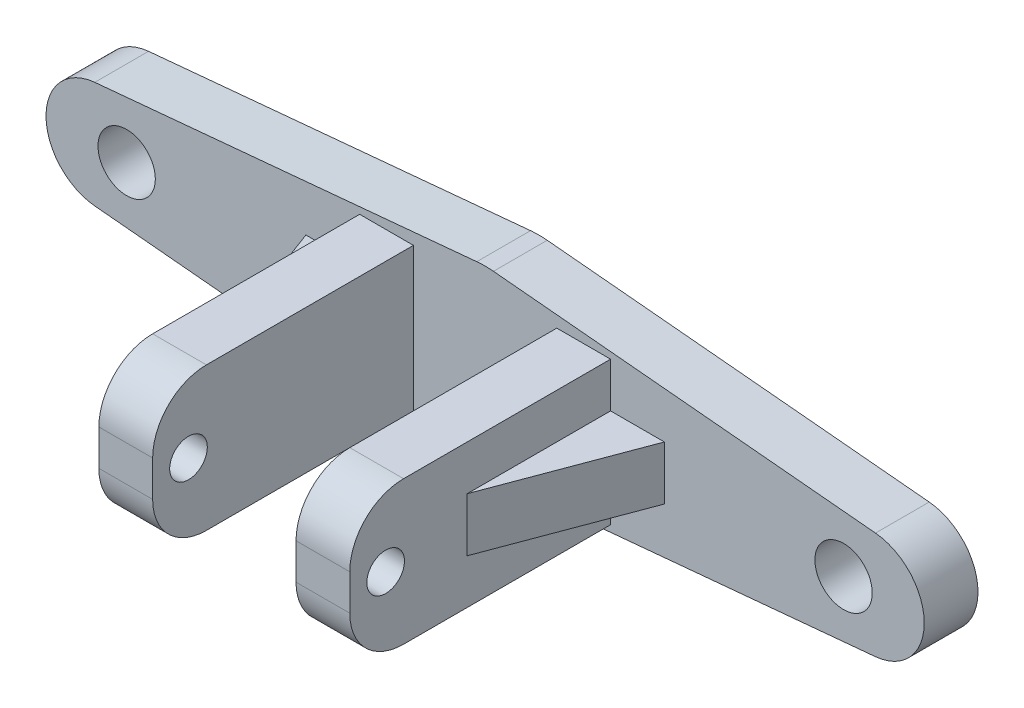
ISO-10303-21;
HEADER;
FILE_DESCRIPTION(('STEP AP214'),'2;1');
FILE_NAME('part.step','',(''),(''),'','','');
FILE_SCHEMA(('AUTOMOTIVE_DESIGN { 1 0 10303 214 1 1 1 1 }'));
ENDSEC;
DATA;
#1=APPLICATION_CONTEXT('core data for automotive mechanical design processes');
#2=APPLICATION_PROTOCOL_DEFINITION('international standard','automotive_design',2000,#1);
#3=PRODUCT_CONTEXT('',#1,'mechanical');
#4=PRODUCT('Part','Part','',(#3));
#5=PRODUCT_RELATED_PRODUCT_CATEGORY('part','',(#4));
#6=PRODUCT_DEFINITION_FORMATION('','',#4);
#7=PRODUCT_DEFINITION_CONTEXT('part definition',#1,'design');
#8=PRODUCT_DEFINITION('design','',#6,#7);
#9=PRODUCT_DEFINITION_SHAPE('','',#8);
#10=(LENGTH_UNIT() NAMED_UNIT(*) SI_UNIT(.MILLI.,.METRE.));
#11=(NAMED_UNIT(*) PLANE_ANGLE_UNIT() SI_UNIT($,.RADIAN.));
#12=(NAMED_UNIT(*) SI_UNIT($,.STERADIAN.) SOLID_ANGLE_UNIT());
#13=UNCERTAINTY_MEASURE_WITH_UNIT(LENGTH_MEASURE(1.E-05),#10,'distance_accuracy_value','');
#14=(GEOMETRIC_REPRESENTATION_CONTEXT(3) GLOBAL_UNCERTAINTY_ASSIGNED_CONTEXT((#13)) GLOBAL_UNIT_ASSIGNED_CONTEXT((#10,
#11,#12)) REPRESENTATION_CONTEXT('',''));
#15=CARTESIAN_POINT('',(0.,0.,0.));
#16=DIRECTION('',(0.,0.,1.));
#17=DIRECTION('',(1.,0.,0.));
#18=AXIS2_PLACEMENT_3D('',#15,#16,#17);
#19=CARTESIAN_POINT('',(7.,-4.,17.55));
#20=DIRECTION('',(0.,1.,0.));
#21=DIRECTION('',(-1.,0.,0.));
#22=AXIS2_PLACEMENT_3D('',#19,#20,#21);
#23=PLANE('',#22);
#24=DIRECTION('',(0.,0.,1.));
#25=VECTOR('',#24,1.);
#26=CARTESIAN_POINT('',(-4.,-4.,17.55));
#27=LINE('',#26,#25);
#28=CARTESIAN_POINT('',(-4.,-4.,3.));
#29=VERTEX_POINT('',#28);
#30=CARTESIAN_POINT('',(-4.,-4.,14.55));
#31=VERTEX_POINT('',#30);
#32=EDGE_CURVE('E310',#29,#31,#27,.T.);
#33=ORIENTED_EDGE('',*,*,#32,.T.);
#34=DIRECTION('',(1.,0.,0.));
#35=VECTOR('',#34,1.);
#36=CARTESIAN_POINT('',(-7.,-4.,14.55));
#37=LINE('',#36,#35);
#38=CARTESIAN_POINT('',(-7.,-4.,14.55));
#39=VERTEX_POINT('',#38);
#40=EDGE_CURVE('E497',#31,#39,#37,.F.);
#41=ORIENTED_EDGE('',*,*,#40,.T.);
#42=DIRECTION('',(0.,0.,-1.));
#43=VECTOR('',#42,1.);
#44=CARTESIAN_POINT('',(-7.,-4.,17.55));
#45=LINE('',#44,#43);
#46=CARTESIAN_POINT('',(-7.,-4.,3.));
#47=VERTEX_POINT('',#46);
#48=EDGE_CURVE('E350',#39,#47,#45,.T.);
#49=ORIENTED_EDGE('',*,*,#48,.T.);
#50=DIRECTION('',(1.,0.,0.));
#51=VECTOR('',#50,1.);
#52=CARTESIAN_POINT('',(7.,-4.,3.));
#53=LINE('',#52,#51);
#54=EDGE_CURVE('E329',#47,#29,#53,.T.);
#55=ORIENTED_EDGE('',*,*,#54,.T.);
#56=EDGE_LOOP('',(#33,#41,#49,#55));
#57=FACE_BOUND('',#56,.T.);
#58=ADVANCED_FACE('F42',(#57),#23,.F.);
#59=CARTESIAN_POINT('',(7.,4.,17.55));
#60=DIRECTION('',(0.,-1.,0.));
#61=DIRECTION('',(1.,0.,0.));
#62=AXIS2_PLACEMENT_3D('',#59,#60,#61);
#63=PLANE('',#62);
#64=DIRECTION('',(0.,0.,-1.));
#65=VECTOR('',#64,1.);
#66=CARTESIAN_POINT('',(-7.,4.,17.55));
#67=LINE('',#66,#65);
#68=CARTESIAN_POINT('',(-7.,4.,14.55));
#69=VERTEX_POINT('',#68);
#70=CARTESIAN_POINT('',(-7.,4.,3.));
#71=VERTEX_POINT('',#70);
#72=EDGE_CURVE('E324',#69,#71,#67,.T.);
#73=ORIENTED_EDGE('',*,*,#72,.F.);
#74=DIRECTION('',(-1.,0.,0.));
#75=VECTOR('',#74,1.);
#76=CARTESIAN_POINT('',(-4.,4.,14.55));
#77=LINE('',#76,#75);
#78=CARTESIAN_POINT('',(-4.,4.,14.55));
#79=VERTEX_POINT('',#78);
#80=EDGE_CURVE('E11',#69,#79,#77,.F.);
#81=ORIENTED_EDGE('',*,*,#80,.T.);
#82=DIRECTION('',(0.,0.,1.));
#83=VECTOR('',#82,1.);
#84=CARTESIAN_POINT('',(-4.,4.,17.55));
#85=LINE('',#84,#83);
#86=CARTESIAN_POINT('',(-4.,4.,3.));
#87=VERTEX_POINT('',#86);
#88=EDGE_CURVE('E293',#87,#79,#85,.T.);
#89=ORIENTED_EDGE('',*,*,#88,.F.);
#90=DIRECTION('',(-1.,0.,0.));
#91=VECTOR('',#90,1.);
#92=CARTESIAN_POINT('',(7.,4.,3.));
#93=LINE('',#92,#91);
#94=EDGE_CURVE('E337',#87,#71,#93,.T.);
#95=ORIENTED_EDGE('',*,*,#94,.T.);
#96=EDGE_LOOP('',(#73,#81,#89,#95));
#97=FACE_BOUND('',#96,.T.);
#98=ADVANCED_FACE('F525',(#97),#63,.F.);
#99=CARTESIAN_POINT('',(0.,0.,17.55));
#100=DIRECTION('',(0.,0.,1.));
#101=DIRECTION('',(1.,0.,0.));
#102=AXIS2_PLACEMENT_3D('',#99,#100,#101);
#103=PLANE('',#102);
#104=DIRECTION('',(1.,0.,0.));
#105=VECTOR('',#104,1.);
#106=CARTESIAN_POINT('',(-4.,-1.,17.55));
#107=LINE('',#106,#105);
#108=CARTESIAN_POINT('',(-7.,-1.,17.55));
#109=VERTEX_POINT('',#108);
#110=CARTESIAN_POINT('',(-4.,-1.,17.55));
#111=VERTEX_POINT('',#110);
#112=EDGE_CURVE('E488',#109,#111,#107,.T.);
#113=ORIENTED_EDGE('',*,*,#112,.T.);
#114=DIRECTION('',(0.,-1.,0.));
#115=VECTOR('',#114,1.);
#116=CARTESIAN_POINT('',(-4.,0.,17.55));
#117=LINE('',#116,#115);
#118=CARTESIAN_POINT('',(-4.,1.,17.55));
#119=VERTEX_POINT('',#118);
#120=EDGE_CURVE('E454',#119,#111,#117,.T.);
#121=ORIENTED_EDGE('',*,*,#120,.F.);
#122=DIRECTION('',(-1.,0.,0.));
#123=VECTOR('',#122,1.);
#124=CARTESIAN_POINT('',(-7.,1.,17.55));
#125=LINE('',#124,#123);
#126=CARTESIAN_POINT('',(-7.,1.,17.55));
#127=VERTEX_POINT('',#126);
#128=EDGE_CURVE('E485',#119,#127,#125,.T.);
#129=ORIENTED_EDGE('',*,*,#128,.T.);
#130=DIRECTION('',(0.,-1.,0.));
#131=VECTOR('',#130,1.);
#132=CARTESIAN_POINT('',(-7.,-4.,17.55));
#133=LINE('',#132,#131);
#134=EDGE_CURVE('E315',#127,#109,#133,.T.);
#135=ORIENTED_EDGE('',*,*,#134,.T.);
#136=EDGE_LOOP('',(#113,#121,#129,#135));
#137=FACE_BOUND('',#136,.T.);
#138=ADVANCED_FACE('F510',(#137),#103,.T.);
#139=CARTESIAN_POINT('',(-21.5,0.,3.));
#140=DIRECTION('',(0.,0.,1.));
#141=DIRECTION('',(1.,0.,0.));
#142=AXIS2_PLACEMENT_3D('',#139,#140,#141);
#143=PLANE('',#142);
#144=CARTESIAN_POINT('',(20.,0.,3.));
#145=DIRECTION('',(0.,0.,1.));
#146=DIRECTION('',(1.,0.,0.));
#147=AXIS2_PLACEMENT_3D('',#144,#145,#146);
#148=CIRCLE('',#147,1.6);
#149=CARTESIAN_POINT('',(21.6,0.,3.));
#150=VERTEX_POINT('',#149);
#151=EDGE_CURVE('E364',#150,#150,#148,.T.);
#152=ORIENTED_EDGE('',*,*,#151,.F.);
#153=EDGE_LOOP('',(#152));
#154=FACE_BOUND('',#153,.T.);
#155=DIRECTION('',(-1.,0.,0.));
#156=VECTOR('',#155,1.);
#157=CARTESIAN_POINT('',(-21.5,1.5,3.));
#158=LINE('',#157,#156);
#159=CARTESIAN_POINT('',(9.99999999999999,1.5,3.));
#160=VERTEX_POINT('',#159);
#161=CARTESIAN_POINT('',(7.,1.5,3.));
#162=VERTEX_POINT('',#161);
#163=EDGE_CURVE('E258',#160,#162,#158,.T.);
#164=ORIENTED_EDGE('',*,*,#163,.F.);
#165=DIRECTION('',(0.,-1.,0.));
#166=VECTOR('',#165,1.);
#167=CARTESIAN_POINT('',(9.99999999999999,0.,3.));
#168=LINE('',#167,#166);
#169=CARTESIAN_POINT('',(10.,-1.5,3.));
#170=VERTEX_POINT('',#169);
#171=EDGE_CURVE('E276',#170,#160,#168,.F.);
#172=ORIENTED_EDGE('',*,*,#171,.F.);
#173=DIRECTION('',(-1.,0.,0.));
#174=VECTOR('',#173,1.);
#175=CARTESIAN_POINT('',(-21.5,-1.5,3.));
#176=LINE('',#175,#174);
#177=CARTESIAN_POINT('',(7.,-1.5,3.));
#178=VERTEX_POINT('',#177);
#179=EDGE_CURVE('E265',#170,#178,#176,.T.);
#180=ORIENTED_EDGE('',*,*,#179,.T.);
#181=DIRECTION('',(0.,1.,0.));
#182=VECTOR('',#181,1.);
#183=CARTESIAN_POINT('',(7.,-4.,3.));
#184=LINE('',#183,#182);
#185=CARTESIAN_POINT('',(7.,-4.,3.));
#186=VERTEX_POINT('',#185);
#187=EDGE_CURVE('E334',#186,#178,#184,.T.);
#188=ORIENTED_EDGE('',*,*,#187,.F.);
#189=CARTESIAN_POINT('',(4.,-4.,3.));
#190=VERTEX_POINT('',#189);
#191=EDGE_CURVE('E328',#190,#186,#53,.T.);
#192=ORIENTED_EDGE('',*,*,#191,.F.);
#193=DIRECTION('',(0.,1.,0.));
#194=VECTOR('',#193,1.);
#195=CARTESIAN_POINT('',(4.,-5.,3.));
#196=LINE('',#195,#194);
#197=CARTESIAN_POINT('',(4.,4.,3.));
#198=VERTEX_POINT('',#197);
#199=EDGE_CURVE('E301',#190,#198,#196,.T.);
#200=ORIENTED_EDGE('',*,*,#199,.T.);
#201=CARTESIAN_POINT('',(7.,4.,3.));
#202=VERTEX_POINT('',#201);
#203=EDGE_CURVE('E320',#202,#198,#93,.T.);
#204=ORIENTED_EDGE('',*,*,#203,.F.);
#205=EDGE_CURVE('E333',#162,#202,#184,.T.);
#206=ORIENTED_EDGE('',*,*,#205,.F.);
#207=EDGE_LOOP('',(#164,#172,#180,#188,#192,#200,#204,#206));
#208=FACE_BOUND('',#207,.T.);
#209=ORIENTED_EDGE('',*,*,#94,.F.);
#210=DIRECTION('',(0.,1.,0.));
#211=VECTOR('',#210,1.);
#212=CARTESIAN_POINT('',(-4.,-5.,3.));
#213=LINE('',#212,#211);
#214=EDGE_CURVE('E302',#29,#87,#213,.T.);
#215=ORIENTED_EDGE('',*,*,#214,.F.);
#216=ORIENTED_EDGE('',*,*,#54,.F.);
#217=DIRECTION('',(0.,-1.,0.));
#218=VECTOR('',#217,1.);
#219=CARTESIAN_POINT('',(-7.,-4.,3.));
#220=LINE('',#219,#218);
#221=CARTESIAN_POINT('',(-7.,-1.5,3.));
#222=VERTEX_POINT('',#221);
#223=EDGE_CURVE('E314',#222,#47,#220,.T.);
#224=ORIENTED_EDGE('',*,*,#223,.F.);
#225=DIRECTION('',(-1.,0.,0.));
#226=VECTOR('',#225,1.);
#227=CARTESIAN_POINT('',(-21.5,-1.5,3.));
#228=LINE('',#227,#226);
#229=CARTESIAN_POINT('',(-10.,-1.5,3.));
#230=VERTEX_POINT('',#229);
#231=EDGE_CURVE('E63',#222,#230,#228,.T.);
#232=ORIENTED_EDGE('',*,*,#231,.T.);
#233=DIRECTION('',(0.,-1.,0.));
#234=VECTOR('',#233,1.);
#235=CARTESIAN_POINT('',(-10.,0.,3.));
#236=LINE('',#235,#234);
#237=CARTESIAN_POINT('',(-10.,1.5,3.));
#238=VERTEX_POINT('',#237);
#239=EDGE_CURVE('E58',#238,#230,#236,.T.);
#240=ORIENTED_EDGE('',*,*,#239,.F.);
#241=DIRECTION('',(-1.,0.,0.));
#242=VECTOR('',#241,1.);
#243=CARTESIAN_POINT('',(-21.5,1.5,3.));
#244=LINE('',#243,#242);
#245=CARTESIAN_POINT('',(-7.,1.5,3.));
#246=VERTEX_POINT('',#245);
#247=EDGE_CURVE('E232',#246,#238,#244,.T.);
#248=ORIENTED_EDGE('',*,*,#247,.F.);
#249=EDGE_CURVE('E325',#71,#246,#220,.T.);
#250=ORIENTED_EDGE('',*,*,#249,.F.);
#251=EDGE_LOOP('',(#209,#215,#216,#224,#232,#240,#248,#250));
#252=FACE_BOUND('',#251,.T.);
#253=CARTESIAN_POINT('',(21.5,0.,3.));
#254=DIRECTION('',(0.,0.,1.));
#255=DIRECTION('',(1.,0.,0.));
#256=AXIS2_PLACEMENT_3D('',#253,#254,#255);
#257=CIRCLE('',#256,3.);
#258=CARTESIAN_POINT('',(21.7790697674419,-2.98699180864293,3.));
#259=VERTEX_POINT('',#258);
#260=CARTESIAN_POINT('',(21.7790697674419,2.98699180864292,3.));
#261=VERTEX_POINT('',#260);
#262=EDGE_CURVE('E384',#259,#261,#257,.T.);
#263=ORIENTED_EDGE('',*,*,#262,.T.);
#264=DIRECTION('',(-0.995663936214309,0.0930232558139536,0.));
#265=VECTOR('',#264,1.);
#266=CARTESIAN_POINT('',(0.465116279069768,4.97831968107154,3.));
#267=LINE('',#266,#265);
#268=CARTESIAN_POINT('',(0.465116279069768,4.97831968107154,3.));
#269=VERTEX_POINT('',#268);
#270=EDGE_CURVE('E387',#261,#269,#267,.T.);
#271=ORIENTED_EDGE('',*,*,#270,.T.);
#272=CARTESIAN_POINT('',(0.,0.,3.));
#273=DIRECTION('',(0.,0.,1.));
#274=DIRECTION('',(1.,0.,0.));
#275=AXIS2_PLACEMENT_3D('',#272,#273,#274);
#276=CIRCLE('',#275,5.);
#277=CARTESIAN_POINT('',(-0.465116279069769,4.97831968107154,3.));
#278=VERTEX_POINT('',#277);
#279=EDGE_CURVE('E390',#269,#278,#276,.T.);
#280=ORIENTED_EDGE('',*,*,#279,.T.);
#281=DIRECTION('',(-0.995663936214309,-0.0930232558139538,0.));
#282=VECTOR('',#281,1.);
#283=CARTESIAN_POINT('',(-21.7790697674419,2.98699180864292,3.));
#284=LINE('',#283,#282);
#285=CARTESIAN_POINT('',(-21.7790697674419,2.98699180864292,3.));
#286=VERTEX_POINT('',#285);
#287=EDGE_CURVE('E393',#278,#286,#284,.T.);
#288=ORIENTED_EDGE('',*,*,#287,.T.);
#289=CARTESIAN_POINT('',(-21.5,0.,3.));
#290=DIRECTION('',(0.,0.,1.));
#291=DIRECTION('',(1.,0.,0.));
#292=AXIS2_PLACEMENT_3D('',#289,#290,#291);
#293=CIRCLE('',#292,3.);
#294=CARTESIAN_POINT('',(-21.7790697674419,-2.98699180864293,3.));
#295=VERTEX_POINT('',#294);
#296=EDGE_CURVE('E371',#286,#295,#293,.T.);
#297=ORIENTED_EDGE('',*,*,#296,.T.);
#298=DIRECTION('',(0.995663936214309,-0.0930232558139531,0.));
#299=VECTOR('',#298,1.);
#300=CARTESIAN_POINT('',(-21.7790697674419,-2.98699180864293,3.));
#301=LINE('',#300,#299);
#302=CARTESIAN_POINT('',(-0.465116279069766,-4.97831968107154,3.));
#303=VERTEX_POINT('',#302);
#304=EDGE_CURVE('E374',#295,#303,#301,.T.);
#305=ORIENTED_EDGE('',*,*,#304,.T.);
#306=CARTESIAN_POINT('',(0.,0.,3.));
#307=DIRECTION('',(0.,0.,1.));
#308=DIRECTION('',(1.,0.,0.));
#309=AXIS2_PLACEMENT_3D('',#306,#307,#308);
#310=CIRCLE('',#309,5.);
#311=CARTESIAN_POINT('',(0.465116279069767,-4.97831968107154,3.));
#312=VERTEX_POINT('',#311);
#313=EDGE_CURVE('E378',#303,#312,#310,.T.);
#314=ORIENTED_EDGE('',*,*,#313,.T.);
#315=DIRECTION('',(0.995663936214309,0.0930232558139534,0.));
#316=VECTOR('',#315,1.);
#317=CARTESIAN_POINT('',(21.7790697674419,-2.98699180864293,3.));
#318=LINE('',#317,#316);
#319=EDGE_CURVE('E381',#312,#259,#318,.T.);
#320=ORIENTED_EDGE('',*,*,#319,.T.);
#321=EDGE_LOOP('',(#263,#271,#280,#288,#297,#305,#314,#320));
#322=FACE_BOUND('',#321,.T.);
#323=CARTESIAN_POINT('',(-20.,0.,3.));
#324=DIRECTION('',(0.,0.,1.));
#325=DIRECTION('',(1.,0.,0.));
#326=AXIS2_PLACEMENT_3D('',#323,#324,#325);
#327=CIRCLE('',#326,1.6);
#328=CARTESIAN_POINT('',(-18.4,0.,3.));
#329=VERTEX_POINT('',#328);
#330=EDGE_CURVE('E360',#329,#329,#327,.T.);
#331=ORIENTED_EDGE('',*,*,#330,.F.);
#332=EDGE_LOOP('',(#331));
#333=FACE_BOUND('',#332,.T.);
#334=ADVANCED_FACE('F531',(#154,#208,#252,#322,#333),#143,.T.);
#335=CARTESIAN_POINT('',(-21.5,0.,3.));
#336=DIRECTION('',(0.,0.,-1.));
#337=DIRECTION('',(-1.,0.,0.));
#338=AXIS2_PLACEMENT_3D('',#335,#336,#337);
#339=CYLINDRICAL_SURFACE('',#338,3.);
#340=CARTESIAN_POINT('',(-21.5,0.,0.));
#341=DIRECTION('',(0.,0.,1.));
#342=DIRECTION('',(1.,0.,0.));
#343=AXIS2_PLACEMENT_3D('',#340,#341,#342);
#344=CIRCLE('',#343,3.);
#345=CARTESIAN_POINT('',(-21.7790697674419,2.98699180864292,0.));
#346=VERTEX_POINT('',#345);
#347=CARTESIAN_POINT('',(-21.7790697674419,-2.98699180864293,0.));
#348=VERTEX_POINT('',#347);
#349=EDGE_CURVE('E359',#346,#348,#344,.T.);
#350=ORIENTED_EDGE('',*,*,#349,.T.);
#351=DIRECTION('',(0.,0.,-1.));
#352=VECTOR('',#351,1.);
#353=CARTESIAN_POINT('',(-21.7790697674419,-2.98699180864293,3.));
#354=LINE('',#353,#352);
#355=EDGE_CURVE('E446',#295,#348,#354,.T.);
#356=ORIENTED_EDGE('',*,*,#355,.F.);
#357=ORIENTED_EDGE('',*,*,#296,.F.);
#358=DIRECTION('',(0.,0.,-1.));
#359=VECTOR('',#358,1.);
#360=CARTESIAN_POINT('',(-21.7790697674419,2.98699180864292,3.));
#361=LINE('',#360,#359);
#362=EDGE_CURVE('E396',#286,#346,#361,.T.);
#363=ORIENTED_EDGE('',*,*,#362,.T.);
#364=EDGE_LOOP('',(#350,#356,#357,#363));
#365=FACE_BOUND('',#364,.T.);
#366=ADVANCED_FACE('F716',(#365),#339,.T.);
#367=CARTESIAN_POINT('',(-21.7790697674419,-2.98699180864293,3.));
#368=DIRECTION('',(0.0930232558139531,0.995663936214309,0.));
#369=DIRECTION('',(-0.995663936214309,0.0930232558139531,0.));
#370=AXIS2_PLACEMENT_3D('',#367,#368,#369);
#371=PLANE('',#370);
#372=DIRECTION('',(0.995663936214309,-0.0930232558139531,0.));
#373=VECTOR('',#372,1.);
#374=CARTESIAN_POINT('',(-21.7790697674419,-2.98699180864293,0.));
#375=LINE('',#374,#373);
#376=CARTESIAN_POINT('',(-0.465116279069766,-4.97831968107154,0.));
#377=VERTEX_POINT('',#376);
#378=EDGE_CURVE('E399',#348,#377,#375,.T.);
#379=ORIENTED_EDGE('',*,*,#378,.T.);
#380=DIRECTION('',(0.,0.,-1.));
#381=VECTOR('',#380,1.);
#382=CARTESIAN_POINT('',(-0.465116279069766,-4.97831968107154,3.));
#383=LINE('',#382,#381);
#384=EDGE_CURVE('E442',#303,#377,#383,.T.);
#385=ORIENTED_EDGE('',*,*,#384,.F.);
#386=ORIENTED_EDGE('',*,*,#304,.F.);
#387=ORIENTED_EDGE('',*,*,#355,.T.);
#388=EDGE_LOOP('',(#379,#385,#386,#387));
#389=FACE_BOUND('',#388,.T.);
#390=ADVANCED_FACE('F877',(#389),#371,.F.);
#391=CARTESIAN_POINT('',(0.,0.,3.));
#392=DIRECTION('',(0.,0.,-1.));
#393=DIRECTION('',(-1.,0.,0.));
#394=AXIS2_PLACEMENT_3D('',#391,#392,#393);
#395=CYLINDRICAL_SURFACE('',#394,5.);
#396=CARTESIAN_POINT('',(0.,0.,0.));
#397=DIRECTION('',(0.,0.,1.));
#398=DIRECTION('',(1.,0.,0.));
#399=AXIS2_PLACEMENT_3D('',#396,#397,#398);
#400=CIRCLE('',#399,5.);
#401=CARTESIAN_POINT('',(0.465116279069767,-4.97831968107154,0.));
#402=VERTEX_POINT('',#401);
#403=EDGE_CURVE('E402',#377,#402,#400,.T.);
#404=ORIENTED_EDGE('',*,*,#403,.T.);
#405=DIRECTION('',(0.,0.,-1.));
#406=VECTOR('',#405,1.);
#407=CARTESIAN_POINT('',(0.465116279069767,-4.97831968107154,3.));
#408=LINE('',#407,#406);
#409=EDGE_CURVE('E438',#312,#402,#408,.T.);
#410=ORIENTED_EDGE('',*,*,#409,.F.);
#411=ORIENTED_EDGE('',*,*,#313,.F.);
#412=ORIENTED_EDGE('',*,*,#384,.T.);
#413=EDGE_LOOP('',(#404,#410,#411,#412));
#414=FACE_BOUND('',#413,.T.);
#415=ADVANCED_FACE('F866',(#414),#395,.T.);
#416=CARTESIAN_POINT('',(21.7790697674419,-2.98699180864293,3.));
#417=DIRECTION('',(-0.0930232558139534,0.995663936214309,0.));
#418=DIRECTION('',(-0.995663936214309,-0.0930232558139534,0.));
#419=AXIS2_PLACEMENT_3D('',#416,#417,#418);
#420=PLANE('',#419);
#421=DIRECTION('',(0.995663936214309,0.0930232558139534,0.));
#422=VECTOR('',#421,1.);
#423=CARTESIAN_POINT('',(21.7790697674419,-2.98699180864293,0.));
#424=LINE('',#423,#422);
#425=CARTESIAN_POINT('',(21.7790697674419,-2.98699180864293,0.));
#426=VERTEX_POINT('',#425);
#427=EDGE_CURVE('E405',#402,#426,#424,.T.);
#428=ORIENTED_EDGE('',*,*,#427,.T.);
#429=DIRECTION('',(0.,0.,-1.));
#430=VECTOR('',#429,1.);
#431=CARTESIAN_POINT('',(21.7790697674419,-2.98699180864293,3.));
#432=LINE('',#431,#430);
#433=EDGE_CURVE('E434',#259,#426,#432,.T.);
#434=ORIENTED_EDGE('',*,*,#433,.F.);
#435=ORIENTED_EDGE('',*,*,#319,.F.);
#436=ORIENTED_EDGE('',*,*,#409,.T.);
#437=EDGE_LOOP('',(#428,#434,#435,#436));
#438=FACE_BOUND('',#437,.T.);
#439=ADVANCED_FACE('F731',(#438),#420,.F.);
#440=CARTESIAN_POINT('',(21.5,0.,3.));
#441=DIRECTION('',(0.,0.,-1.));
#442=DIRECTION('',(-1.,0.,0.));
#443=AXIS2_PLACEMENT_3D('',#440,#441,#442);
#444=CYLINDRICAL_SURFACE('',#443,3.);
#445=DIRECTION('',(0.,0.,-1.));
#446=VECTOR('',#445,1.);
#447=CARTESIAN_POINT('',(21.7790697674419,2.98699180864292,3.));
#448=LINE('',#447,#446);
#449=CARTESIAN_POINT('',(21.7790697674419,2.98699180864292,0.));
#450=VERTEX_POINT('',#449);
#451=EDGE_CURVE('E430',#261,#450,#448,.T.);
#452=ORIENTED_EDGE('',*,*,#451,.F.);
#453=ORIENTED_EDGE('',*,*,#262,.F.);
#454=ORIENTED_EDGE('',*,*,#433,.T.);
#455=CARTESIAN_POINT('',(21.5,0.,0.));
#456=DIRECTION('',(0.,0.,1.));
#457=DIRECTION('',(1.,0.,0.));
#458=AXIS2_PLACEMENT_3D('',#455,#456,#457);
#459=CIRCLE('',#458,3.);
#460=EDGE_CURVE('E408',#426,#450,#459,.T.);
#461=ORIENTED_EDGE('',*,*,#460,.T.);
#462=EDGE_LOOP('',(#452,#453,#454,#461));
#463=FACE_BOUND('',#462,.T.);
#464=ADVANCED_FACE('F725',(#463),#444,.T.);
#465=CARTESIAN_POINT('',(0.465116279069768,4.97831968107154,3.));
#466=DIRECTION('',(-0.0930232558139536,-0.995663936214309,0.));
#467=DIRECTION('',(0.995663936214309,-0.0930232558139536,0.));
#468=AXIS2_PLACEMENT_3D('',#465,#466,#467);
#469=PLANE('',#468);
#470=DIRECTION('',(-0.995663936214309,0.0930232558139536,0.));
#471=VECTOR('',#470,1.);
#472=CARTESIAN_POINT('',(0.465116279069768,4.97831968107154,0.));
#473=LINE('',#472,#471);
#474=CARTESIAN_POINT('',(0.465116279069768,4.97831968107154,0.));
#475=VERTEX_POINT('',#474);
#476=EDGE_CURVE('E411',#450,#475,#473,.T.);
#477=ORIENTED_EDGE('',*,*,#476,.T.);
#478=DIRECTION('',(0.,0.,-1.));
#479=VECTOR('',#478,1.);
#480=CARTESIAN_POINT('',(0.465116279069768,4.97831968107154,3.));
#481=LINE('',#480,#479);
#482=EDGE_CURVE('E426',#269,#475,#481,.T.);
#483=ORIENTED_EDGE('',*,*,#482,.F.);
#484=ORIENTED_EDGE('',*,*,#270,.F.);
#485=ORIENTED_EDGE('',*,*,#451,.T.);
#486=EDGE_LOOP('',(#477,#483,#484,#485));
#487=FACE_BOUND('',#486,.T.);
#488=ADVANCED_FACE('F730',(#487),#469,.F.);
#489=CARTESIAN_POINT('',(0.,0.,3.));
#490=DIRECTION('',(0.,0.,-1.));
#491=DIRECTION('',(-1.,0.,0.));
#492=AXIS2_PLACEMENT_3D('',#489,#490,#491);
#493=CYLINDRICAL_SURFACE('',#492,5.);
#494=CARTESIAN_POINT('',(0.,0.,0.));
#495=DIRECTION('',(0.,0.,1.));
#496=DIRECTION('',(1.,0.,0.));
#497=AXIS2_PLACEMENT_3D('',#494,#495,#496);
#498=CIRCLE('',#497,5.);
#499=CARTESIAN_POINT('',(-0.465116279069769,4.97831968107154,0.));
#500=VERTEX_POINT('',#499);
#501=EDGE_CURVE('E414',#475,#500,#498,.T.);
#502=ORIENTED_EDGE('',*,*,#501,.T.);
#503=DIRECTION('',(0.,0.,-1.));
#504=VECTOR('',#503,1.);
#505=CARTESIAN_POINT('',(-0.465116279069769,4.97831968107154,3.));
#506=LINE('',#505,#504);
#507=EDGE_CURVE('E422',#278,#500,#506,.T.);
#508=ORIENTED_EDGE('',*,*,#507,.F.);
#509=ORIENTED_EDGE('',*,*,#279,.F.);
#510=ORIENTED_EDGE('',*,*,#482,.T.);
#511=EDGE_LOOP('',(#502,#508,#509,#510));
#512=FACE_BOUND('',#511,.T.);
#513=ADVANCED_FACE('F897',(#512),#493,.T.);
#514=CARTESIAN_POINT('',(-21.7790697674419,2.98699180864292,3.));
#515=DIRECTION('',(0.0930232558139538,-0.995663936214309,0.));
#516=DIRECTION('',(0.995663936214309,0.0930232558139538,0.));
#517=AXIS2_PLACEMENT_3D('',#514,#515,#516);
#518=PLANE('',#517);
#519=DIRECTION('',(-0.995663936214309,-0.0930232558139538,0.));
#520=VECTOR('',#519,1.);
#521=CARTESIAN_POINT('',(-21.7790697674419,2.98699180864292,0.));
#522=LINE('',#521,#520);
#523=EDGE_CURVE('E375',#500,#346,#522,.T.);
#524=ORIENTED_EDGE('',*,*,#523,.T.);
#525=ORIENTED_EDGE('',*,*,#362,.F.);
#526=ORIENTED_EDGE('',*,*,#287,.F.);
#527=ORIENTED_EDGE('',*,*,#507,.T.);
#528=EDGE_LOOP('',(#524,#525,#526,#527));
#529=FACE_BOUND('',#528,.T.);
#530=ADVANCED_FACE('F748',(#529),#518,.F.);
#531=CARTESIAN_POINT('',(-21.5,0.,0.));
#532=DIRECTION('',(0.,0.,1.));
#533=DIRECTION('',(1.,0.,0.));
#534=AXIS2_PLACEMENT_3D('',#531,#532,#533);
#535=PLANE('',#534);
#536=CARTESIAN_POINT('',(20.,0.,0.));
#537=DIRECTION('',(0.,0.,1.));
#538=DIRECTION('',(1.,0.,0.));
#539=AXIS2_PLACEMENT_3D('',#536,#537,#538);
#540=CIRCLE('',#539,1.6);
#541=CARTESIAN_POINT('',(21.6,0.,0.));
#542=VERTEX_POINT('',#541);
#543=EDGE_CURVE('E354',#542,#542,#540,.T.);
#544=ORIENTED_EDGE('',*,*,#543,.T.);
#545=EDGE_LOOP('',(#544));
#546=FACE_BOUND('',#545,.T.);
#547=CARTESIAN_POINT('',(-20.,0.,0.));
#548=DIRECTION('',(0.,0.,1.));
#549=DIRECTION('',(1.,0.,0.));
#550=AXIS2_PLACEMENT_3D('',#547,#548,#549);
#551=CIRCLE('',#550,1.6);
#552=CARTESIAN_POINT('',(-18.4,0.,0.));
#553=VERTEX_POINT('',#552);
#554=EDGE_CURVE('E355',#553,#553,#551,.T.);
#555=ORIENTED_EDGE('',*,*,#554,.T.);
#556=EDGE_LOOP('',(#555));
#557=FACE_BOUND('',#556,.T.);
#558=ORIENTED_EDGE('',*,*,#476,.F.);
#559=ORIENTED_EDGE('',*,*,#460,.F.);
#560=ORIENTED_EDGE('',*,*,#427,.F.);
#561=ORIENTED_EDGE('',*,*,#403,.F.);
#562=ORIENTED_EDGE('',*,*,#378,.F.);
#563=ORIENTED_EDGE('',*,*,#349,.F.);
#564=ORIENTED_EDGE('',*,*,#523,.F.);
#565=ORIENTED_EDGE('',*,*,#501,.F.);
#566=EDGE_LOOP('',(#558,#559,#560,#561,#562,#563,#564,#565));
#567=FACE_BOUND('',#566,.T.);
#568=ADVANCED_FACE('F742',(#546,#557,#567),#535,.F.);
#569=CARTESIAN_POINT('',(20.,0.,0.));
#570=DIRECTION('',(0.,0.,1.));
#571=DIRECTION('',(1.,0.,0.));
#572=AXIS2_PLACEMENT_3D('',#569,#570,#571);
#573=CYLINDRICAL_SURFACE('',#572,1.6);
#574=ORIENTED_EDGE('',*,*,#543,.F.);
#575=EDGE_LOOP('',(#574));
#576=FACE_BOUND('',#575,.T.);
#577=ORIENTED_EDGE('',*,*,#151,.T.);
#578=EDGE_LOOP('',(#577));
#579=FACE_BOUND('',#578,.T.);
#580=ADVANCED_FACE('F747',(#576,#579),#573,.F.);
#581=CARTESIAN_POINT('',(-20.,0.,0.));
#582=DIRECTION('',(0.,0.,1.));
#583=DIRECTION('',(1.,0.,0.));
#584=AXIS2_PLACEMENT_3D('',#581,#582,#583);
#585=CYLINDRICAL_SURFACE('',#584,1.6);
#586=ORIENTED_EDGE('',*,*,#554,.F.);
#587=EDGE_LOOP('',(#586));
#588=FACE_BOUND('',#587,.T.);
#589=ORIENTED_EDGE('',*,*,#330,.T.);
#590=EDGE_LOOP('',(#589));
#591=FACE_BOUND('',#590,.T.);
#592=ADVANCED_FACE('F560',(#588,#591),#585,.F.);
#593=CARTESIAN_POINT('',(-7.,-4.,17.55));
#594=DIRECTION('',(1.,0.,0.));
#595=DIRECTION('',(0.,0.,-1.));
#596=AXIS2_PLACEMENT_3D('',#593,#594,#595);
#597=PLANE('',#596);
#598=ORIENTED_EDGE('',*,*,#249,.T.);
#599=DIRECTION('',(0.,0.,1.));
#600=VECTOR('',#599,1.);
#601=CARTESIAN_POINT('',(-7.,1.5,17.55));
#602=LINE('',#601,#600);
#603=CARTESIAN_POINT('',(-7.,1.5,11.));
#604=VERTEX_POINT('',#603);
#605=EDGE_CURVE('E220',#246,#604,#602,.T.);
#606=ORIENTED_EDGE('',*,*,#605,.T.);
#607=DIRECTION('',(0.,-1.,0.));
#608=VECTOR('',#607,1.);
#609=CARTESIAN_POINT('',(-7.,-4.,11.));
#610=LINE('',#609,#608);
#611=CARTESIAN_POINT('',(-7.,-1.5,11.));
#612=VERTEX_POINT('',#611);
#613=EDGE_CURVE('E213',#604,#612,#610,.T.);
#614=ORIENTED_EDGE('',*,*,#613,.T.);
#615=DIRECTION('',(0.,0.,1.));
#616=VECTOR('',#615,1.);
#617=CARTESIAN_POINT('',(-7.,-1.5,17.55));
#618=LINE('',#617,#616);
#619=EDGE_CURVE('E218',#222,#612,#618,.T.);
#620=ORIENTED_EDGE('',*,*,#619,.F.);
#621=ORIENTED_EDGE('',*,*,#223,.T.);
#622=ORIENTED_EDGE('',*,*,#48,.F.);
#623=CARTESIAN_POINT('',(-7.,-1.,14.55));
#624=DIRECTION('',(1.,0.,0.));
#625=DIRECTION('',(0.,0.,-1.));
#626=AXIS2_PLACEMENT_3D('',#623,#624,#625);
#627=CIRCLE('',#626,3.);
#628=EDGE_CURVE('E51',#39,#109,#627,.F.);
#629=ORIENTED_EDGE('',*,*,#628,.T.);
#630=ORIENTED_EDGE('',*,*,#134,.F.);
#631=CARTESIAN_POINT('',(-7.,1.,14.55));
#632=DIRECTION('',(1.,0.,0.));
#633=DIRECTION('',(0.,0.,-1.));
#634=AXIS2_PLACEMENT_3D('',#631,#632,#633);
#635=CIRCLE('',#634,3.);
#636=EDGE_CURVE('E500',#127,#69,#635,.F.);
#637=ORIENTED_EDGE('',*,*,#636,.T.);
#638=ORIENTED_EDGE('',*,*,#72,.T.);
#639=EDGE_LOOP('',(#598,#606,#614,#620,#621,#622,#629,#630,#637,#638));
#640=FACE_BOUND('',#639,.T.);
#641=CARTESIAN_POINT('',(-7.,0.,15.55));
#642=DIRECTION('',(1.,0.,0.));
#643=DIRECTION('',(0.,0.,-1.));
#644=AXIS2_PLACEMENT_3D('',#641,#642,#643);
#645=CIRCLE('',#644,1.05);
#646=CARTESIAN_POINT('',(-7.,0.,14.5));
#647=VERTEX_POINT('',#646);
#648=EDGE_CURVE('E289',#647,#647,#645,.T.);
#649=ORIENTED_EDGE('',*,*,#648,.T.);
#650=EDGE_LOOP('',(#649));
#651=FACE_BOUND('',#650,.T.);
#652=ADVANCED_FACE('F216',(#640,#651),#597,.F.);
#653=DIRECTION('',(0.,0.,-1.));
#654=VECTOR('',#653,1.);
#655=CARTESIAN_POINT('',(7.,-4.,17.55));
#656=LINE('',#655,#654);
#657=CARTESIAN_POINT('',(7.,-4.,14.55));
#658=VERTEX_POINT('',#657);
#659=EDGE_CURVE('E347',#658,#186,#656,.T.);
#660=ORIENTED_EDGE('',*,*,#659,.F.);
#661=DIRECTION('',(1.,0.,0.));
#662=VECTOR('',#661,1.);
#663=CARTESIAN_POINT('',(4.,-4.,14.55));
#664=LINE('',#663,#662);
#665=CARTESIAN_POINT('',(4.,-4.,14.55));
#666=VERTEX_POINT('',#665);
#667=EDGE_CURVE('E482',#658,#666,#664,.F.);
#668=ORIENTED_EDGE('',*,*,#667,.T.);
#669=DIRECTION('',(0.,0.,-1.));
#670=VECTOR('',#669,1.);
#671=CARTESIAN_POINT('',(4.,-4.,17.55));
#672=LINE('',#671,#670);
#673=EDGE_CURVE('E305',#666,#190,#672,.T.);
#674=ORIENTED_EDGE('',*,*,#673,.T.);
#675=ORIENTED_EDGE('',*,*,#191,.T.);
#676=EDGE_LOOP('',(#660,#668,#674,#675));
#677=FACE_BOUND('',#676,.T.);
#678=ADVANCED_FACE('F544',(#677),#23,.F.);
#679=CARTESIAN_POINT('',(7.,-4.,17.55));
#680=DIRECTION('',(-1.,0.,0.));
#681=DIRECTION('',(0.,0.,1.));
#682=AXIS2_PLACEMENT_3D('',#679,#680,#681);
#683=PLANE('',#682);
#684=CARTESIAN_POINT('',(7.,1.,14.55));
#685=DIRECTION('',(-1.,0.,0.));
#686=DIRECTION('',(0.,0.,1.));
#687=AXIS2_PLACEMENT_3D('',#684,#685,#686);
#688=CIRCLE('',#687,3.);
#689=CARTESIAN_POINT('',(7.,4.,14.55));
#690=VERTEX_POINT('',#689);
#691=CARTESIAN_POINT('',(7.,1.,17.55));
#692=VERTEX_POINT('',#691);
#693=EDGE_CURVE('E479',#690,#692,#688,.F.);
#694=ORIENTED_EDGE('',*,*,#693,.T.);
#695=DIRECTION('',(0.,1.,0.));
#696=VECTOR('',#695,1.);
#697=CARTESIAN_POINT('',(7.,-4.,17.55));
#698=LINE('',#697,#696);
#699=CARTESIAN_POINT('',(7.,-0.999999999999998,17.55));
#700=VERTEX_POINT('',#699);
#701=EDGE_CURVE('E319',#700,#692,#698,.T.);
#702=ORIENTED_EDGE('',*,*,#701,.F.);
#703=CARTESIAN_POINT('',(7.,-0.999999999999998,14.55));
#704=DIRECTION('',(-1.,0.,0.));
#705=DIRECTION('',(0.,0.,1.));
#706=AXIS2_PLACEMENT_3D('',#703,#704,#705);
#707=CIRCLE('',#706,3.);
#708=EDGE_CURVE('E476',#700,#658,#707,.F.);
#709=ORIENTED_EDGE('',*,*,#708,.T.);
#710=ORIENTED_EDGE('',*,*,#659,.T.);
#711=ORIENTED_EDGE('',*,*,#187,.T.);
#712=DIRECTION('',(0.,0.,-1.));
#713=VECTOR('',#712,1.);
#714=CARTESIAN_POINT('',(7.,-1.5,17.55));
#715=LINE('',#714,#713);
#716=CARTESIAN_POINT('',(7.,-1.5,11.));
#717=VERTEX_POINT('',#716);
#718=EDGE_CURVE('E262',#717,#178,#715,.T.);
#719=ORIENTED_EDGE('',*,*,#718,.F.);
#720=DIRECTION('',(0.,-1.,0.));
#721=VECTOR('',#720,1.);
#722=CARTESIAN_POINT('',(7.,-4.,11.));
#723=LINE('',#722,#721);
#724=CARTESIAN_POINT('',(7.,1.5,11.));
#725=VERTEX_POINT('',#724);
#726=EDGE_CURVE('E269',#717,#725,#723,.F.);
#727=ORIENTED_EDGE('',*,*,#726,.T.);
#728=DIRECTION('',(0.,0.,-1.));
#729=VECTOR('',#728,1.);
#730=CARTESIAN_POINT('',(7.,1.5,17.55));
#731=LINE('',#730,#729);
#732=EDGE_CURVE('E254',#725,#162,#731,.T.);
#733=ORIENTED_EDGE('',*,*,#732,.T.);
#734=ORIENTED_EDGE('',*,*,#205,.T.);
#735=DIRECTION('',(0.,0.,-1.));
#736=VECTOR('',#735,1.);
#737=CARTESIAN_POINT('',(7.,4.,17.55));
#738=LINE('',#737,#736);
#739=EDGE_CURVE('E343',#690,#202,#738,.T.);
#740=ORIENTED_EDGE('',*,*,#739,.F.);
#741=EDGE_LOOP('',(#694,#702,#709,#710,#711,#719,#727,#733,#734,#740));
#742=FACE_BOUND('',#741,.T.);
#743=CARTESIAN_POINT('',(7.,0.,15.55));
#744=DIRECTION('',(1.,0.,0.));
#745=DIRECTION('',(0.,0.,-1.));
#746=AXIS2_PLACEMENT_3D('',#743,#744,#745);
#747=CIRCLE('',#746,1.05);
#748=CARTESIAN_POINT('',(7.,0.,14.5));
#749=VERTEX_POINT('',#748);
#750=EDGE_CURVE('E280',#749,#749,#747,.T.);
#751=ORIENTED_EDGE('',*,*,#750,.F.);
#752=EDGE_LOOP('',(#751));
#753=FACE_BOUND('',#752,.T.);
#754=ADVANCED_FACE('F553',(#742,#753),#683,.F.);
#755=DIRECTION('',(0.,0.,-1.));
#756=VECTOR('',#755,1.);
#757=CARTESIAN_POINT('',(4.,4.,17.55));
#758=LINE('',#757,#756);
#759=CARTESIAN_POINT('',(4.,4.,14.55));
#760=VERTEX_POINT('',#759);
#761=EDGE_CURVE('E297',#760,#198,#758,.T.);
#762=ORIENTED_EDGE('',*,*,#761,.F.);
#763=DIRECTION('',(-1.,0.,0.));
#764=VECTOR('',#763,1.);
#765=CARTESIAN_POINT('',(7.,4.,14.55));
#766=LINE('',#765,#764);
#767=EDGE_CURVE('E473',#760,#690,#766,.F.);
#768=ORIENTED_EDGE('',*,*,#767,.T.);
#769=ORIENTED_EDGE('',*,*,#739,.T.);
#770=ORIENTED_EDGE('',*,*,#203,.T.);
#771=EDGE_LOOP('',(#762,#768,#769,#770));
#772=FACE_BOUND('',#771,.T.);
#773=ADVANCED_FACE('F549',(#772),#63,.F.);
#774=DIRECTION('',(-1.,0.,0.));
#775=VECTOR('',#774,1.);
#776=CARTESIAN_POINT('',(4.,1.,17.55));
#777=LINE('',#776,#775);
#778=CARTESIAN_POINT('',(4.,1.,17.55));
#779=VERTEX_POINT('',#778);
#780=EDGE_CURVE('E464',#692,#779,#777,.T.);
#781=ORIENTED_EDGE('',*,*,#780,.T.);
#782=DIRECTION('',(0.,1.,0.));
#783=VECTOR('',#782,1.);
#784=CARTESIAN_POINT('',(4.,0.,17.55));
#785=LINE('',#784,#783);
#786=CARTESIAN_POINT('',(4.,-0.999999999999999,17.55));
#787=VERTEX_POINT('',#786);
#788=EDGE_CURVE('E450',#787,#779,#785,.T.);
#789=ORIENTED_EDGE('',*,*,#788,.F.);
#790=DIRECTION('',(1.,0.,0.));
#791=VECTOR('',#790,1.);
#792=CARTESIAN_POINT('',(7.,-0.999999999999998,17.55));
#793=LINE('',#792,#791);
#794=EDGE_CURVE('E458',#787,#700,#793,.T.);
#795=ORIENTED_EDGE('',*,*,#794,.T.);
#796=ORIENTED_EDGE('',*,*,#701,.T.);
#797=EDGE_LOOP('',(#781,#789,#795,#796));
#798=FACE_BOUND('',#797,.T.);
#799=ADVANCED_FACE('F579',(#798),#103,.T.);
#800=CARTESIAN_POINT('',(-4.,-5.,17.55));
#801=DIRECTION('',(-1.,0.,0.));
#802=DIRECTION('',(0.,-1.,0.));
#803=AXIS2_PLACEMENT_3D('',#800,#801,#802);
#804=PLANE('',#803);
#805=CARTESIAN_POINT('',(-4.,1.,14.55));
#806=DIRECTION('',(-1.,0.,0.));
#807=DIRECTION('',(0.,-1.,0.));
#808=AXIS2_PLACEMENT_3D('',#805,#806,#807);
#809=CIRCLE('',#808,3.);
#810=EDGE_CURVE('E491',#79,#119,#809,.F.);
#811=ORIENTED_EDGE('',*,*,#810,.T.);
#812=ORIENTED_EDGE('',*,*,#120,.T.);
#813=CARTESIAN_POINT('',(-4.,-1.,14.55));
#814=DIRECTION('',(-1.,0.,0.));
#815=DIRECTION('',(0.,-1.,0.));
#816=AXIS2_PLACEMENT_3D('',#813,#814,#815);
#817=CIRCLE('',#816,3.);
#818=EDGE_CURVE('E494',#111,#31,#817,.F.);
#819=ORIENTED_EDGE('',*,*,#818,.T.);
#820=ORIENTED_EDGE('',*,*,#32,.F.);
#821=ORIENTED_EDGE('',*,*,#214,.T.);
#822=ORIENTED_EDGE('',*,*,#88,.T.);
#823=EDGE_LOOP('',(#811,#812,#819,#820,#821,#822));
#824=FACE_BOUND('',#823,.T.);
#825=CARTESIAN_POINT('',(-4.,0.,15.55));
#826=DIRECTION('',(-1.,0.,0.));
#827=DIRECTION('',(0.,-1.,0.));
#828=AXIS2_PLACEMENT_3D('',#825,#826,#827);
#829=CIRCLE('',#828,1.05);
#830=CARTESIAN_POINT('',(-4.,-1.05,15.55));
#831=VERTEX_POINT('',#830);
#832=EDGE_CURVE('E285',#831,#831,#829,.T.);
#833=ORIENTED_EDGE('',*,*,#832,.T.);
#834=EDGE_LOOP('',(#833));
#835=FACE_BOUND('',#834,.T.);
#836=ADVANCED_FACE('F517',(#824,#835),#804,.F.);
#837=CARTESIAN_POINT('',(4.,-5.,17.55));
#838=DIRECTION('',(1.,0.,0.));
#839=DIRECTION('',(0.,1.,0.));
#840=AXIS2_PLACEMENT_3D('',#837,#838,#839);
#841=PLANE('',#840);
#842=ORIENTED_EDGE('',*,*,#761,.T.);
#843=ORIENTED_EDGE('',*,*,#199,.F.);
#844=ORIENTED_EDGE('',*,*,#673,.F.);
#845=CARTESIAN_POINT('',(4.,-0.999999999999999,14.55));
#846=DIRECTION('',(1.,0.,0.));
#847=DIRECTION('',(0.,1.,0.));
#848=AXIS2_PLACEMENT_3D('',#845,#846,#847);
#849=CIRCLE('',#848,3.);
#850=EDGE_CURVE('E467',#666,#787,#849,.F.);
#851=ORIENTED_EDGE('',*,*,#850,.T.);
#852=ORIENTED_EDGE('',*,*,#788,.T.);
#853=CARTESIAN_POINT('',(4.,1.,14.55));
#854=DIRECTION('',(1.,0.,0.));
#855=DIRECTION('',(0.,1.,0.));
#856=AXIS2_PLACEMENT_3D('',#853,#854,#855);
#857=CIRCLE('',#856,3.);
#858=EDGE_CURVE('E470',#779,#760,#857,.F.);
#859=ORIENTED_EDGE('',*,*,#858,.T.);
#860=EDGE_LOOP('',(#842,#843,#844,#851,#852,#859));
#861=FACE_BOUND('',#860,.T.);
#862=CARTESIAN_POINT('',(4.,0.,15.55));
#863=DIRECTION('',(1.,0.,0.));
#864=DIRECTION('',(0.,1.,0.));
#865=AXIS2_PLACEMENT_3D('',#862,#863,#864);
#866=CIRCLE('',#865,1.05);
#867=CARTESIAN_POINT('',(4.,1.05,15.55));
#868=VERTEX_POINT('',#867);
#869=EDGE_CURVE('E284',#868,#868,#866,.T.);
#870=ORIENTED_EDGE('',*,*,#869,.T.);
#871=EDGE_LOOP('',(#870));
#872=FACE_BOUND('',#871,.T.);
#873=ADVANCED_FACE('F575',(#861,#872),#841,.F.);
#874=CARTESIAN_POINT('',(-24.5,0.,15.55));
#875=DIRECTION('',(1.,0.,0.));
#876=DIRECTION('',(0.,0.,-1.));
#877=AXIS2_PLACEMENT_3D('',#874,#875,#876);
#878=CYLINDRICAL_SURFACE('',#877,1.05);
#879=ORIENTED_EDGE('',*,*,#750,.T.);
#880=EDGE_LOOP('',(#879));
#881=FACE_BOUND('',#880,.T.);
#882=ORIENTED_EDGE('',*,*,#869,.F.);
#883=EDGE_LOOP('',(#882));
#884=FACE_BOUND('',#883,.T.);
#885=ADVANCED_FACE('F620',(#881,#884),#878,.F.);
#886=ORIENTED_EDGE('',*,*,#648,.F.);
#887=EDGE_LOOP('',(#886));
#888=FACE_BOUND('',#887,.T.);
#889=ORIENTED_EDGE('',*,*,#832,.F.);
#890=EDGE_LOOP('',(#889));
#891=FACE_BOUND('',#890,.T.);
#892=ADVANCED_FACE('F617',(#888,#891),#878,.F.);
#893=CARTESIAN_POINT('',(0.,1.,14.55));
#894=DIRECTION('',(1.,0.,0.));
#895=DIRECTION('',(0.,1.,0.));
#896=AXIS2_PLACEMENT_3D('',#893,#894,#895);
#897=CYLINDRICAL_SURFACE('',#896,3.);
#898=ORIENTED_EDGE('',*,*,#767,.F.);
#899=ORIENTED_EDGE('',*,*,#858,.F.);
#900=ORIENTED_EDGE('',*,*,#780,.F.);
#901=ORIENTED_EDGE('',*,*,#693,.F.);
#902=EDGE_LOOP('',(#898,#899,#900,#901));
#903=FACE_BOUND('',#902,.T.);
#904=ADVANCED_FACE('F585',(#903),#897,.T.);
#905=CARTESIAN_POINT('',(0.,-0.999999999999999,14.55));
#906=DIRECTION('',(-1.,0.,0.));
#907=DIRECTION('',(0.,-1.,0.));
#908=AXIS2_PLACEMENT_3D('',#905,#906,#907);
#909=CYLINDRICAL_SURFACE('',#908,3.);
#910=ORIENTED_EDGE('',*,*,#794,.F.);
#911=ORIENTED_EDGE('',*,*,#850,.F.);
#912=ORIENTED_EDGE('',*,*,#667,.F.);
#913=ORIENTED_EDGE('',*,*,#708,.F.);
#914=EDGE_LOOP('',(#910,#911,#912,#913));
#915=FACE_BOUND('',#914,.T.);
#916=ADVANCED_FACE('F571',(#915),#909,.T.);
#917=CARTESIAN_POINT('',(0.,-0.999999999999999,14.55));
#918=DIRECTION('',(-1.,0.,0.));
#919=DIRECTION('',(0.,-1.,0.));
#920=AXIS2_PLACEMENT_3D('',#917,#918,#919);
#921=CYLINDRICAL_SURFACE('',#920,3.);
#922=ORIENTED_EDGE('',*,*,#818,.F.);
#923=ORIENTED_EDGE('',*,*,#112,.F.);
#924=ORIENTED_EDGE('',*,*,#628,.F.);
#925=ORIENTED_EDGE('',*,*,#40,.F.);
#926=EDGE_LOOP('',(#922,#923,#924,#925));
#927=FACE_BOUND('',#926,.T.);
#928=ADVANCED_FACE('F515',(#927),#921,.T.);
#929=CARTESIAN_POINT('',(0.,1.,14.55));
#930=DIRECTION('',(1.,0.,0.));
#931=DIRECTION('',(0.,1.,0.));
#932=AXIS2_PLACEMENT_3D('',#929,#930,#931);
#933=CYLINDRICAL_SURFACE('',#932,3.);
#934=ORIENTED_EDGE('',*,*,#636,.F.);
#935=ORIENTED_EDGE('',*,*,#128,.F.);
#936=ORIENTED_EDGE('',*,*,#810,.F.);
#937=ORIENTED_EDGE('',*,*,#80,.F.);
#938=EDGE_LOOP('',(#934,#935,#936,#937));
#939=FACE_BOUND('',#938,.T.);
#940=ADVANCED_FACE('F44',(#939),#933,.T.);
#941=CARTESIAN_POINT('',(10.,0.,3.));
#942=DIRECTION('',(-0.936329177569045,0.,-0.351123441588392));
#943=DIRECTION('',(-0.351123441588392,0.,0.936329177569045));
#944=AXIS2_PLACEMENT_3D('',#941,#942,#943);
#945=PLANE('',#944);
#946=DIRECTION('',(-0.351123441588392,0.,0.936329177569045));
#947=VECTOR('',#946,1.);
#948=CARTESIAN_POINT('',(10.,-1.5,3.));
#949=LINE('',#948,#947);
#950=EDGE_CURVE('E249',#170,#717,#949,.T.);
#951=ORIENTED_EDGE('',*,*,#950,.F.);
#952=ORIENTED_EDGE('',*,*,#171,.T.);
#953=DIRECTION('',(-0.351123441588392,0.,0.936329177569045));
#954=VECTOR('',#953,1.);
#955=CARTESIAN_POINT('',(10.,1.5,3.));
#956=LINE('',#955,#954);
#957=EDGE_CURVE('E250',#160,#725,#956,.T.);
#958=ORIENTED_EDGE('',*,*,#957,.T.);
#959=ORIENTED_EDGE('',*,*,#726,.F.);
#960=EDGE_LOOP('',(#951,#952,#958,#959));
#961=FACE_BOUND('',#960,.T.);
#962=ADVANCED_FACE('F604',(#961),#945,.F.);
#963=CARTESIAN_POINT('',(0.,-1.5,8.775));
#964=DIRECTION('',(0.,1.,0.));
#965=DIRECTION('',(-1.,0.,0.));
#966=AXIS2_PLACEMENT_3D('',#963,#964,#965);
#967=PLANE('',#966);
#968=ORIENTED_EDGE('',*,*,#179,.F.);
#969=ORIENTED_EDGE('',*,*,#950,.T.);
#970=ORIENTED_EDGE('',*,*,#718,.T.);
#971=EDGE_LOOP('',(#968,#969,#970));
#972=FACE_BOUND('',#971,.T.);
#973=ADVANCED_FACE('F606',(#972),#967,.F.);
#974=CARTESIAN_POINT('',(0.,1.5,8.775));
#975=DIRECTION('',(0.,1.,0.));
#976=DIRECTION('',(-1.,0.,0.));
#977=AXIS2_PLACEMENT_3D('',#974,#975,#976);
#978=PLANE('',#977);
#979=ORIENTED_EDGE('',*,*,#732,.F.);
#980=ORIENTED_EDGE('',*,*,#957,.F.);
#981=ORIENTED_EDGE('',*,*,#163,.T.);
#982=EDGE_LOOP('',(#979,#980,#981));
#983=FACE_BOUND('',#982,.T.);
#984=ADVANCED_FACE('F600',(#983),#978,.T.);
#985=CARTESIAN_POINT('',(-10.,0.,3.));
#986=DIRECTION('',(-0.936329177569045,0.,0.351123441588392));
#987=DIRECTION('',(0.351123441588392,0.,0.936329177569045));
#988=AXIS2_PLACEMENT_3D('',#985,#986,#987);
#989=PLANE('',#988);
#990=DIRECTION('',(0.351123441588392,0.,0.936329177569045));
#991=VECTOR('',#990,1.);
#992=CARTESIAN_POINT('',(-10.,1.5,3.));
#993=LINE('',#992,#991);
#994=EDGE_CURVE('E236',#238,#604,#993,.T.);
#995=ORIENTED_EDGE('',*,*,#994,.F.);
#996=ORIENTED_EDGE('',*,*,#239,.T.);
#997=DIRECTION('',(0.351123441588392,0.,0.936329177569045));
#998=VECTOR('',#997,1.);
#999=CARTESIAN_POINT('',(-10.,-1.5,3.));
#1000=LINE('',#999,#998);
#1001=EDGE_CURVE('E230',#230,#612,#1000,.T.);
#1002=ORIENTED_EDGE('',*,*,#1001,.T.);
#1003=ORIENTED_EDGE('',*,*,#613,.F.);
#1004=EDGE_LOOP('',(#995,#996,#1002,#1003));
#1005=FACE_BOUND('',#1004,.T.);
#1006=ADVANCED_FACE('F234',(#1005),#989,.T.);
#1007=CARTESIAN_POINT('',(0.,-1.5,8.775));
#1008=DIRECTION('',(0.,1.,0.));
#1009=DIRECTION('',(-1.,0.,0.));
#1010=AXIS2_PLACEMENT_3D('',#1007,#1008,#1009);
#1011=PLANE('',#1010);
#1012=ORIENTED_EDGE('',*,*,#231,.F.);
#1013=ORIENTED_EDGE('',*,*,#619,.T.);
#1014=ORIENTED_EDGE('',*,*,#1001,.F.);
#1015=EDGE_LOOP('',(#1012,#1013,#1014));
#1016=FACE_BOUND('',#1015,.T.);
#1017=ADVANCED_FACE('F229',(#1016),#1011,.F.);
#1018=CARTESIAN_POINT('',(0.,1.5,8.775));
#1019=DIRECTION('',(0.,1.,0.));
#1020=DIRECTION('',(-1.,0.,0.));
#1021=AXIS2_PLACEMENT_3D('',#1018,#1019,#1020);
#1022=PLANE('',#1021);
#1023=ORIENTED_EDGE('',*,*,#994,.T.);
#1024=ORIENTED_EDGE('',*,*,#605,.F.);
#1025=ORIENTED_EDGE('',*,*,#247,.T.);
#1026=EDGE_LOOP('',(#1023,#1024,#1025));
#1027=FACE_BOUND('',#1026,.T.);
#1028=ADVANCED_FACE('F534',(#1027),#1022,.T.);
#1029=CLOSED_SHELL('',(#58,#98,#138,#334,#366,#390,#415,#439,#464,#488,#513,#530,#568,#580,#592,
#652,#678,#754,#773,#799,#836,#873,#885,#892,#904,#916,#928,#940,#962,#973,#984,#1006,#1017,#1028));
#1030=MANIFOLD_SOLID_BREP('B2',#1029);
#1031=ADVANCED_BREP_SHAPE_REPRESENTATION('',(#18,#1030),#14);
#1032=SHAPE_DEFINITION_REPRESENTATION(#9,#1031);
ENDSEC;
END-ISO-10303-21;
